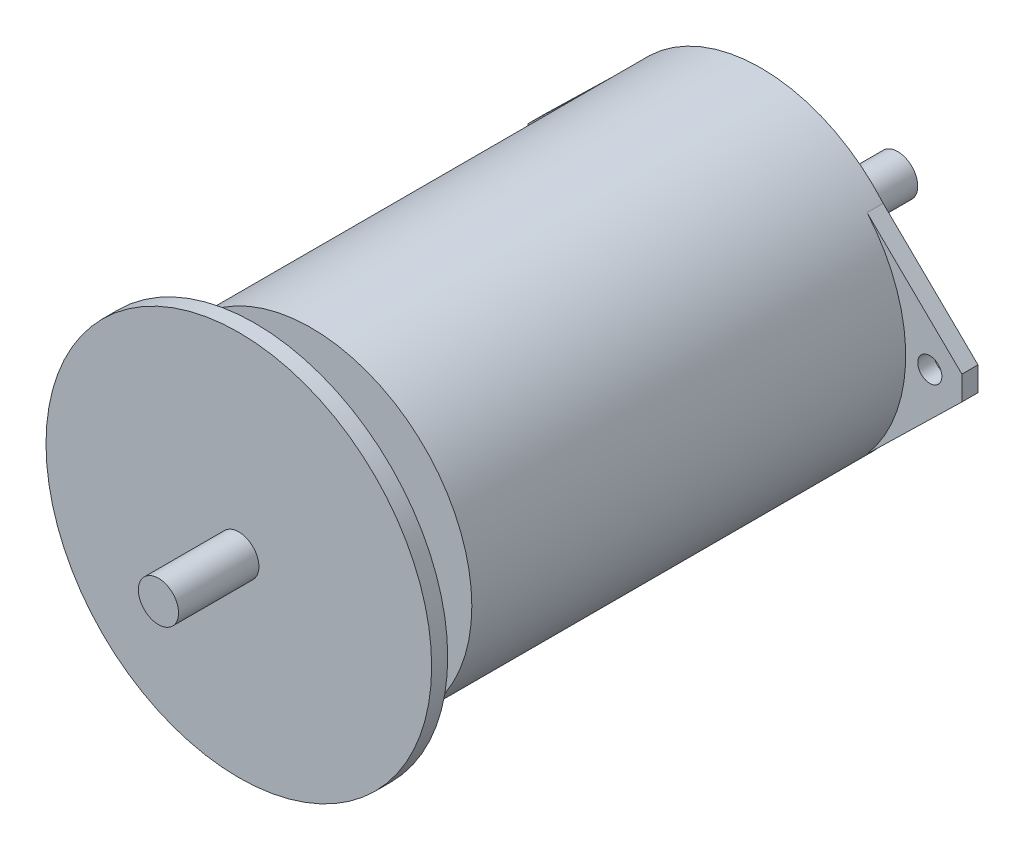
ISO-10303-21;
HEADER;
FILE_DESCRIPTION(('STEP AP214'),'2;1');
FILE_NAME('part.step','',(''),(''),'','','');
FILE_SCHEMA(('AUTOMOTIVE_DESIGN { 1 0 10303 214 1 1 1 1 }'));
ENDSEC;
DATA;
#1=APPLICATION_CONTEXT('core data for automotive mechanical design processes');
#2=APPLICATION_PROTOCOL_DEFINITION('international standard','automotive_design',2000,#1);
#3=PRODUCT_CONTEXT('',#1,'mechanical');
#4=PRODUCT('Part','Part','',(#3));
#5=PRODUCT_RELATED_PRODUCT_CATEGORY('part','',(#4));
#6=PRODUCT_DEFINITION_FORMATION('','',#4);
#7=PRODUCT_DEFINITION_CONTEXT('part definition',#1,'design');
#8=PRODUCT_DEFINITION('design','',#6,#7);
#9=PRODUCT_DEFINITION_SHAPE('','',#8);
#10=(LENGTH_UNIT() NAMED_UNIT(*) SI_UNIT(.MILLI.,.METRE.));
#11=(NAMED_UNIT(*) PLANE_ANGLE_UNIT() SI_UNIT($,.RADIAN.));
#12=(NAMED_UNIT(*) SI_UNIT($,.STERADIAN.) SOLID_ANGLE_UNIT());
#13=UNCERTAINTY_MEASURE_WITH_UNIT(LENGTH_MEASURE(1.E-05),#10,'distance_accuracy_value','');
#14=(GEOMETRIC_REPRESENTATION_CONTEXT(3) GLOBAL_UNCERTAINTY_ASSIGNED_CONTEXT((#13)) GLOBAL_UNIT_ASSIGNED_CONTEXT((#10,
#11,#12)) REPRESENTATION_CONTEXT('',''));
#15=CARTESIAN_POINT('',(0.,0.,0.));
#16=DIRECTION('',(0.,0.,1.));
#17=DIRECTION('',(1.,0.,0.));
#18=AXIS2_PLACEMENT_3D('',#15,#16,#17);
#19=CARTESIAN_POINT('',(-44.2121087681845,22.8987714087123,-17.));
#20=DIRECTION('',(0.,0.,1.));
#21=DIRECTION('',(1.,0.,0.));
#22=AXIS2_PLACEMENT_3D('',#19,#20,#21);
#23=CYLINDRICAL_SURFACE('',#22,2.49999999999999);
#24=CARTESIAN_POINT('',(-44.2121087681845,22.8987714087123,56.));
#25=DIRECTION('',(0.,0.,1.));
#26=DIRECTION('',(1.,0.,0.));
#27=AXIS2_PLACEMENT_3D('',#24,#25,#26);
#28=CIRCLE('',#27,2.49999999999999);
#29=CARTESIAN_POINT('',(-41.7121087681845,22.8987714087123,56.));
#30=VERTEX_POINT('',#29);
#31=EDGE_CURVE('E11',#30,#30,#28,.T.);
#32=ORIENTED_EDGE('',*,*,#31,.T.);
#33=EDGE_LOOP('',(#32));
#34=FACE_BOUND('',#33,.T.);
#35=CARTESIAN_POINT('',(-44.2121087681845,22.8987714087123,63.));
#36=DIRECTION('',(0.,0.,1.));
#37=DIRECTION('',(1.,0.,0.));
#38=AXIS2_PLACEMENT_3D('',#35,#36,#37);
#39=CIRCLE('',#38,2.49999999999999);
#40=CARTESIAN_POINT('',(-41.7121087681845,22.8987714087123,63.));
#41=VERTEX_POINT('',#40);
#42=EDGE_CURVE('E392',#41,#41,#39,.T.);
#43=ORIENTED_EDGE('',*,*,#42,.F.);
#44=EDGE_LOOP('',(#43));
#45=FACE_BOUND('',#44,.T.);
#46=ADVANCED_FACE('F34',(#34,#45),#23,.T.);
#47=CARTESIAN_POINT('',(-44.2121087681849,22.898771408712,56.));
#48=DIRECTION('',(0.,0.,-1.));
#49=DIRECTION('',(-1.,0.,0.));
#50=AXIS2_PLACEMENT_3D('',#47,#48,#49);
#51=CYLINDRICAL_SURFACE('',#50,20.);
#52=CARTESIAN_POINT('',(-44.2121087681849,22.898771408712,56.));
#53=DIRECTION('',(0.,0.,1.));
#54=DIRECTION('',(1.,0.,0.));
#55=AXIS2_PLACEMENT_3D('',#52,#53,#54);
#56=CIRCLE('',#55,20.);
#57=CARTESIAN_POINT('',(-24.2121087681849,22.898771408712,56.));
#58=VERTEX_POINT('',#57);
#59=EDGE_CURVE('E43',#58,#58,#56,.T.);
#60=ORIENTED_EDGE('',*,*,#59,.F.);
#61=EDGE_LOOP('',(#60));
#62=FACE_BOUND('',#61,.T.);
#63=CARTESIAN_POINT('',(-44.2121087681849,22.898771408712,0.));
#64=DIRECTION('',(0.,0.,1.));
#65=DIRECTION('',(1.,0.,0.));
#66=AXIS2_PLACEMENT_3D('',#63,#64,#65);
#67=CIRCLE('',#66,20.);
#68=CARTESIAN_POINT('',(-29.0183486906998,35.9045260853088,0.));
#69=VERTEX_POINT('',#68);
#70=CARTESIAN_POINT('',(-59.4058688456781,35.9045260852993,0.));
#71=VERTEX_POINT('',#70);
#72=EDGE_CURVE('E38',#69,#71,#67,.T.);
#73=ORIENTED_EDGE('',*,*,#72,.T.);
#74=DIRECTION('',(0.,0.,-1.));
#75=VECTOR('',#74,1.);
#76=CARTESIAN_POINT('',(-59.4058688456781,35.9045260852993,2.));
#77=LINE('',#76,#75);
#78=CARTESIAN_POINT('',(-59.4058688456781,35.9045260852993,2.));
#79=VERTEX_POINT('',#78);
#80=EDGE_CURVE('E56',#79,#71,#77,.T.);
#81=ORIENTED_EDGE('',*,*,#80,.F.);
#82=CARTESIAN_POINT('',(-44.2121087681849,22.898771408712,2.));
#83=DIRECTION('',(0.,0.,1.));
#84=DIRECTION('',(1.,0.,0.));
#85=AXIS2_PLACEMENT_3D('',#82,#83,#84);
#86=CIRCLE('',#85,20.);
#87=CARTESIAN_POINT('',(-59.4058688456781,9.89301673212458,2.));
#88=VERTEX_POINT('',#87);
#89=EDGE_CURVE('E51',#79,#88,#86,.T.);
#90=ORIENTED_EDGE('',*,*,#89,.T.);
#91=DIRECTION('',(0.,0.,-1.));
#92=VECTOR('',#91,1.);
#93=CARTESIAN_POINT('',(-59.4058688456781,9.89301673212458,2.));
#94=LINE('',#93,#92);
#95=CARTESIAN_POINT('',(-59.4058688456781,9.89301673212458,0.));
#96=VERTEX_POINT('',#95);
#97=EDGE_CURVE('E121',#88,#96,#94,.T.);
#98=ORIENTED_EDGE('',*,*,#97,.T.);
#99=CARTESIAN_POINT('',(-29.0183486906925,9.89301673212366,0.));
#100=VERTEX_POINT('',#99);
#101=EDGE_CURVE('E174',#96,#100,#67,.T.);
#102=ORIENTED_EDGE('',*,*,#101,.T.);
#103=DIRECTION('',(0.,0.,-1.));
#104=VECTOR('',#103,1.);
#105=CARTESIAN_POINT('',(-29.0183486906925,9.89301673212368,2.));
#106=LINE('',#105,#104);
#107=CARTESIAN_POINT('',(-29.0183486906925,9.89301673212368,2.));
#108=VERTEX_POINT('',#107);
#109=EDGE_CURVE('E172',#108,#100,#106,.T.);
#110=ORIENTED_EDGE('',*,*,#109,.F.);
#111=CARTESIAN_POINT('',(-44.2121087681849,22.898771408712,2.));
#112=DIRECTION('',(0.,0.,1.));
#113=DIRECTION('',(1.,0.,0.));
#114=AXIS2_PLACEMENT_3D('',#111,#112,#113);
#115=CIRCLE('',#114,20.);
#116=CARTESIAN_POINT('',(-29.0183486906998,35.9045260853088,2.));
#117=VERTEX_POINT('',#116);
#118=EDGE_CURVE('E143',#108,#117,#115,.T.);
#119=ORIENTED_EDGE('',*,*,#118,.T.);
#120=DIRECTION('',(0.,0.,-1.));
#121=VECTOR('',#120,1.);
#122=CARTESIAN_POINT('',(-29.0183486906998,35.9045260853088,2.));
#123=LINE('',#122,#121);
#124=EDGE_CURVE('E155',#117,#69,#123,.T.);
#125=ORIENTED_EDGE('',*,*,#124,.T.);
#126=EDGE_LOOP('',(#73,#81,#90,#98,#102,#110,#119,#125));
#127=FACE_BOUND('',#126,.T.);
#128=ADVANCED_FACE('F36',(#62,#127),#51,.T.);
#129=CARTESIAN_POINT('',(-44.2121087681849,22.898771408712,56.));
#130=DIRECTION('',(0.,0.,1.));
#131=DIRECTION('',(1.,0.,0.));
#132=AXIS2_PLACEMENT_3D('',#129,#130,#131);
#133=PLANE('',#132);
#134=ORIENTED_EDGE('',*,*,#31,.F.);
#135=EDGE_LOOP('',(#134));
#136=FACE_BOUND('',#135,.T.);
#137=ORIENTED_EDGE('',*,*,#59,.T.);
#138=EDGE_LOOP('',(#137));
#139=FACE_BOUND('',#138,.T.);
#140=ADVANCED_FACE('F218',(#136,#139),#133,.T.);
#141=CARTESIAN_POINT('',(-44.2121087681849,22.898771408712,0.));
#142=DIRECTION('',(0.,0.,1.));
#143=DIRECTION('',(1.,0.,0.));
#144=AXIS2_PLACEMENT_3D('',#141,#142,#143);
#145=PLANE('',#144);
#146=CARTESIAN_POINT('',(-44.2121087681849,22.898771408712,0.));
#147=DIRECTION('',(0.,0.,1.));
#148=DIRECTION('',(1.,0.,0.));
#149=AXIS2_PLACEMENT_3D('',#146,#147,#148);
#150=CIRCLE('',#149,9.);
#151=CARTESIAN_POINT('',(-35.2121087681849,22.898771408712,0.));
#152=VERTEX_POINT('',#151);
#153=EDGE_CURVE('E244',#152,#152,#150,.T.);
#154=ORIENTED_EDGE('',*,*,#153,.T.);
#155=EDGE_LOOP('',(#154));
#156=FACE_BOUND('',#155,.T.);
#157=ORIENTED_EDGE('',*,*,#72,.F.);
#158=DIRECTION('',(-0.716144688760475,0.697951849886626,0.));
#159=VECTOR('',#158,1.);
#160=CARTESIAN_POINT('',(3.81041613341323,3.90973858204455,0.));
#161=LINE('',#160,#159);
#162=CARTESIAN_POINT('',(-17.2123905551227,24.3984848484854,0.));
#163=VERTEX_POINT('',#162);
#164=EDGE_CURVE('E144',#163,#69,#161,.T.);
#165=ORIENTED_EDGE('',*,*,#164,.F.);
#166=DIRECTION('',(0.,-1.,0.));
#167=VECTOR('',#166,1.);
#168=CARTESIAN_POINT('',(-17.2123905551229,0.,0.));
#169=LINE('',#168,#167);
#170=CARTESIAN_POINT('',(-17.2123905551228,21.3990579689396,0.));
#171=VERTEX_POINT('',#170);
#172=EDGE_CURVE('E161',#163,#171,#169,.T.);
#173=ORIENTED_EDGE('',*,*,#172,.T.);
#174=DIRECTION('',(-0.716144688760485,-0.697951849886615,0.));
#175=VECTOR('',#174,1.);
#176=CARTESIAN_POINT('',(-19.0807762539914,19.5781364773845,0.));
#177=LINE('',#176,#175);
#178=EDGE_CURVE('E158',#171,#100,#177,.T.);
#179=ORIENTED_EDGE('',*,*,#178,.T.);
#180=ORIENTED_EDGE('',*,*,#101,.F.);
#181=DIRECTION('',(0.71614468876048,-0.69795184988662,0.));
#182=VECTOR('',#181,1.);
#183=CARTESIAN_POINT('',(-23.9939127716081,-24.6193389941738,0.));
#184=LINE('',#183,#182);
#185=CARTESIAN_POINT('',(-71.2118269812462,21.3990579689391,0.));
#186=VERTEX_POINT('',#185);
#187=EDGE_CURVE('E132',#186,#96,#184,.T.);
#188=ORIENTED_EDGE('',*,*,#187,.F.);
#189=DIRECTION('',(0.,1.,0.));
#190=VECTOR('',#189,1.);
#191=CARTESIAN_POINT('',(-71.2118269812462,0.,0.));
#192=LINE('',#191,#190);
#193=CARTESIAN_POINT('',(-71.2118269812462,24.3984848484849,0.));
#194=VERTEX_POINT('',#193);
#195=EDGE_CURVE('E130',#186,#194,#192,.T.);
#196=ORIENTED_EDGE('',*,*,#195,.T.);
#197=DIRECTION('',(0.71614468876048,0.69795184988662,0.));
#198=VECTOR('',#197,1.);
#199=CARTESIAN_POINT('',(-46.8851051590124,48.1072140536023,0.));
#200=LINE('',#199,#198);
#201=EDGE_CURVE('E105',#194,#71,#200,.T.);
#202=ORIENTED_EDGE('',*,*,#201,.T.);
#203=EDGE_LOOP('',(#157,#165,#173,#179,#180,#188,#196,#202));
#204=FACE_BOUND('',#203,.T.);
#205=CARTESIAN_POINT('',(-21.2121087681849,22.898771408712,0.));
#206=DIRECTION('',(0.,0.,1.));
#207=DIRECTION('',(1.,0.,0.));
#208=AXIS2_PLACEMENT_3D('',#205,#206,#207);
#209=CIRCLE('',#208,1.5);
#210=CARTESIAN_POINT('',(-19.7121087681849,22.898771408712,0.));
#211=VERTEX_POINT('',#210);
#212=EDGE_CURVE('E139',#211,#211,#209,.T.);
#213=ORIENTED_EDGE('',*,*,#212,.T.);
#214=EDGE_LOOP('',(#213));
#215=FACE_BOUND('',#214,.T.);
#216=CARTESIAN_POINT('',(-67.2121087681849,22.8987714087121,0.));
#217=DIRECTION('',(0.,0.,1.));
#218=DIRECTION('',(1.,0.,0.));
#219=AXIS2_PLACEMENT_3D('',#216,#217,#218);
#220=CIRCLE('',#219,1.50000000000001);
#221=CARTESIAN_POINT('',(-65.7121087681849,22.8987714087121,0.));
#222=VERTEX_POINT('',#221);
#223=EDGE_CURVE('E125',#222,#222,#220,.T.);
#224=ORIENTED_EDGE('',*,*,#223,.T.);
#225=EDGE_LOOP('',(#224));
#226=FACE_BOUND('',#225,.T.);
#227=ADVANCED_FACE('F186',(#156,#204,#215,#226),#145,.F.);
#228=CARTESIAN_POINT('',(-19.0807762539914,19.5781364773845,2.));
#229=DIRECTION('',(0.697951849886615,-0.716144688760485,0.));
#230=DIRECTION('',(0.716144688760485,0.697951849886615,0.));
#231=AXIS2_PLACEMENT_3D('',#228,#229,#230);
#232=PLANE('',#231);
#233=ORIENTED_EDGE('',*,*,#178,.F.);
#234=DIRECTION('',(0.,0.,-1.));
#235=VECTOR('',#234,1.);
#236=CARTESIAN_POINT('',(-17.2123905551228,21.3990579689396,2.));
#237=LINE('',#236,#235);
#238=CARTESIAN_POINT('',(-17.2123905551228,21.3990579689396,2.));
#239=VERTEX_POINT('',#238);
#240=EDGE_CURVE('E170',#239,#171,#237,.T.);
#241=ORIENTED_EDGE('',*,*,#240,.F.);
#242=DIRECTION('',(-0.716144688760485,-0.697951849886615,0.));
#243=VECTOR('',#242,1.);
#244=CARTESIAN_POINT('',(-19.0807762539914,19.5781364773845,2.));
#245=LINE('',#244,#243);
#246=EDGE_CURVE('E146',#239,#108,#245,.T.);
#247=ORIENTED_EDGE('',*,*,#246,.T.);
#248=ORIENTED_EDGE('',*,*,#109,.T.);
#249=EDGE_LOOP('',(#233,#241,#247,#248));
#250=FACE_BOUND('',#249,.T.);
#251=ADVANCED_FACE('F184',(#250),#232,.T.);
#252=CARTESIAN_POINT('',(-17.2123905551229,0.,2.));
#253=DIRECTION('',(1.,0.,0.));
#254=DIRECTION('',(0.,1.,0.));
#255=AXIS2_PLACEMENT_3D('',#252,#253,#254);
#256=PLANE('',#255);
#257=ORIENTED_EDGE('',*,*,#172,.F.);
#258=DIRECTION('',(0.,0.,-1.));
#259=VECTOR('',#258,1.);
#260=CARTESIAN_POINT('',(-17.2123905551227,24.3984848484854,2.));
#261=LINE('',#260,#259);
#262=CARTESIAN_POINT('',(-17.2123905551227,24.3984848484854,2.));
#263=VERTEX_POINT('',#262);
#264=EDGE_CURVE('E168',#263,#163,#261,.T.);
#265=ORIENTED_EDGE('',*,*,#264,.F.);
#266=DIRECTION('',(0.,-1.,0.));
#267=VECTOR('',#266,1.);
#268=CARTESIAN_POINT('',(-17.2123905551229,0.,2.));
#269=LINE('',#268,#267);
#270=EDGE_CURVE('E149',#263,#239,#269,.T.);
#271=ORIENTED_EDGE('',*,*,#270,.T.);
#272=ORIENTED_EDGE('',*,*,#240,.T.);
#273=EDGE_LOOP('',(#257,#265,#271,#272));
#274=FACE_BOUND('',#273,.T.);
#275=ADVANCED_FACE('F191',(#274),#256,.T.);
#276=CARTESIAN_POINT('',(-21.2121087681849,22.898771408712,2.));
#277=DIRECTION('',(0.,0.,-1.));
#278=DIRECTION('',(-1.,0.,0.));
#279=AXIS2_PLACEMENT_3D('',#276,#277,#278);
#280=CYLINDRICAL_SURFACE('',#279,1.5);
#281=CARTESIAN_POINT('',(-21.2121087681849,22.898771408712,2.));
#282=DIRECTION('',(0.,0.,1.));
#283=DIRECTION('',(1.,0.,0.));
#284=AXIS2_PLACEMENT_3D('',#281,#282,#283);
#285=CIRCLE('',#284,1.5);
#286=CARTESIAN_POINT('',(-19.7121087681849,22.898771408712,2.));
#287=VERTEX_POINT('',#286);
#288=EDGE_CURVE('E140',#287,#287,#285,.T.);
#289=ORIENTED_EDGE('',*,*,#288,.T.);
#290=EDGE_LOOP('',(#289));
#291=FACE_BOUND('',#290,.T.);
#292=ORIENTED_EDGE('',*,*,#212,.F.);
#293=EDGE_LOOP('',(#292));
#294=FACE_BOUND('',#293,.T.);
#295=ADVANCED_FACE('F200',(#291,#294),#280,.F.);
#296=CARTESIAN_POINT('',(3.81041613341323,3.90973858204455,2.));
#297=DIRECTION('',(-0.697951849886626,-0.716144688760475,0.));
#298=DIRECTION('',(0.716144688760475,-0.697951849886626,0.));
#299=AXIS2_PLACEMENT_3D('',#296,#297,#298);
#300=PLANE('',#299);
#301=ORIENTED_EDGE('',*,*,#164,.T.);
#302=ORIENTED_EDGE('',*,*,#124,.F.);
#303=DIRECTION('',(-0.716144688760475,0.697951849886626,0.));
#304=VECTOR('',#303,1.);
#305=CARTESIAN_POINT('',(3.81041613341323,3.90973858204455,2.));
#306=LINE('',#305,#304);
#307=EDGE_CURVE('E152',#263,#117,#306,.T.);
#308=ORIENTED_EDGE('',*,*,#307,.F.);
#309=ORIENTED_EDGE('',*,*,#264,.T.);
#310=EDGE_LOOP('',(#301,#302,#308,#309));
#311=FACE_BOUND('',#310,.T.);
#312=ADVANCED_FACE('F198',(#311),#300,.F.);
#313=CARTESIAN_POINT('',(0.,0.,2.));
#314=DIRECTION('',(0.,0.,1.));
#315=DIRECTION('',(1.,0.,0.));
#316=AXIS2_PLACEMENT_3D('',#313,#314,#315);
#317=PLANE('',#316);
#318=ORIENTED_EDGE('',*,*,#288,.F.);
#319=EDGE_LOOP('',(#318));
#320=FACE_BOUND('',#319,.T.);
#321=ORIENTED_EDGE('',*,*,#118,.F.);
#322=ORIENTED_EDGE('',*,*,#246,.F.);
#323=ORIENTED_EDGE('',*,*,#270,.F.);
#324=ORIENTED_EDGE('',*,*,#307,.T.);
#325=EDGE_LOOP('',(#321,#322,#323,#324));
#326=FACE_BOUND('',#325,.T.);
#327=ADVANCED_FACE('F195',(#320,#326),#317,.T.);
#328=CARTESIAN_POINT('',(-46.8851051590124,48.1072140536023,2.));
#329=DIRECTION('',(-0.69795184988662,0.71614468876048,0.));
#330=DIRECTION('',(-0.71614468876048,-0.69795184988662,0.));
#331=AXIS2_PLACEMENT_3D('',#328,#329,#330);
#332=PLANE('',#331);
#333=ORIENTED_EDGE('',*,*,#201,.F.);
#334=DIRECTION('',(0.,0.,-1.));
#335=VECTOR('',#334,1.);
#336=CARTESIAN_POINT('',(-71.2118269812462,24.3984848484849,2.));
#337=LINE('',#336,#335);
#338=CARTESIAN_POINT('',(-71.2118269812462,24.3984848484849,2.));
#339=VERTEX_POINT('',#338);
#340=EDGE_CURVE('E100',#339,#194,#337,.T.);
#341=ORIENTED_EDGE('',*,*,#340,.F.);
#342=DIRECTION('',(0.71614468876048,0.69795184988662,0.));
#343=VECTOR('',#342,1.);
#344=CARTESIAN_POINT('',(-46.8851051590124,48.1072140536023,2.));
#345=LINE('',#344,#343);
#346=EDGE_CURVE('E103',#339,#79,#345,.T.);
#347=ORIENTED_EDGE('',*,*,#346,.T.);
#348=ORIENTED_EDGE('',*,*,#80,.T.);
#349=EDGE_LOOP('',(#333,#341,#347,#348));
#350=FACE_BOUND('',#349,.T.);
#351=ADVANCED_FACE('F102',(#350),#332,.T.);
#352=CARTESIAN_POINT('',(-71.2118269812462,0.,2.));
#353=DIRECTION('',(-1.,0.,0.));
#354=DIRECTION('',(0.,0.,1.));
#355=AXIS2_PLACEMENT_3D('',#352,#353,#354);
#356=PLANE('',#355);
#357=ORIENTED_EDGE('',*,*,#195,.F.);
#358=DIRECTION('',(0.,0.,-1.));
#359=VECTOR('',#358,1.);
#360=CARTESIAN_POINT('',(-71.2118269812462,21.3990579689391,2.));
#361=LINE('',#360,#359);
#362=CARTESIAN_POINT('',(-71.2118269812462,21.3990579689391,2.));
#363=VERTEX_POINT('',#362);
#364=EDGE_CURVE('E110',#363,#186,#361,.T.);
#365=ORIENTED_EDGE('',*,*,#364,.F.);
#366=DIRECTION('',(0.,1.,0.));
#367=VECTOR('',#366,1.);
#368=CARTESIAN_POINT('',(-71.2118269812462,0.,2.));
#369=LINE('',#368,#367);
#370=EDGE_CURVE('E115',#363,#339,#369,.T.);
#371=ORIENTED_EDGE('',*,*,#370,.T.);
#372=ORIENTED_EDGE('',*,*,#340,.T.);
#373=EDGE_LOOP('',(#357,#365,#371,#372));
#374=FACE_BOUND('',#373,.T.);
#375=ADVANCED_FACE('F117',(#374),#356,.T.);
#376=CARTESIAN_POINT('',(-67.2121087681849,22.8987714087121,2.));
#377=DIRECTION('',(0.,0.,-1.));
#378=DIRECTION('',(-1.,0.,0.));
#379=AXIS2_PLACEMENT_3D('',#376,#377,#378);
#380=CYLINDRICAL_SURFACE('',#379,1.50000000000001);
#381=CARTESIAN_POINT('',(-67.2121087681849,22.8987714087121,2.));
#382=DIRECTION('',(0.,0.,1.));
#383=DIRECTION('',(1.,0.,0.));
#384=AXIS2_PLACEMENT_3D('',#381,#382,#383);
#385=CIRCLE('',#384,1.50000000000001);
#386=CARTESIAN_POINT('',(-65.7121087681849,22.8987714087121,2.));
#387=VERTEX_POINT('',#386);
#388=EDGE_CURVE('E135',#387,#387,#385,.T.);
#389=ORIENTED_EDGE('',*,*,#388,.T.);
#390=EDGE_LOOP('',(#389));
#391=FACE_BOUND('',#390,.T.);
#392=ORIENTED_EDGE('',*,*,#223,.F.);
#393=EDGE_LOOP('',(#392));
#394=FACE_BOUND('',#393,.T.);
#395=ADVANCED_FACE('F257',(#391,#394),#380,.F.);
#396=CARTESIAN_POINT('',(-23.9939127716081,-24.6193389941738,2.));
#397=DIRECTION('',(0.69795184988662,0.71614468876048,0.));
#398=DIRECTION('',(-0.71614468876048,0.69795184988662,0.));
#399=AXIS2_PLACEMENT_3D('',#396,#397,#398);
#400=PLANE('',#399);
#401=ORIENTED_EDGE('',*,*,#187,.T.);
#402=ORIENTED_EDGE('',*,*,#97,.F.);
#403=DIRECTION('',(0.71614468876048,-0.69795184988662,0.));
#404=VECTOR('',#403,1.);
#405=CARTESIAN_POINT('',(-23.9939127716081,-24.6193389941738,2.));
#406=LINE('',#405,#404);
#407=EDGE_CURVE('E119',#363,#88,#406,.T.);
#408=ORIENTED_EDGE('',*,*,#407,.F.);
#409=ORIENTED_EDGE('',*,*,#364,.T.);
#410=EDGE_LOOP('',(#401,#402,#408,#409));
#411=FACE_BOUND('',#410,.T.);
#412=ADVANCED_FACE('F262',(#411),#400,.F.);
#413=CARTESIAN_POINT('',(0.,0.,2.));
#414=DIRECTION('',(0.,0.,1.));
#415=DIRECTION('',(1.,0.,0.));
#416=AXIS2_PLACEMENT_3D('',#413,#414,#415);
#417=PLANE('',#416);
#418=ORIENTED_EDGE('',*,*,#388,.F.);
#419=EDGE_LOOP('',(#418));
#420=FACE_BOUND('',#419,.T.);
#421=ORIENTED_EDGE('',*,*,#89,.F.);
#422=ORIENTED_EDGE('',*,*,#346,.F.);
#423=ORIENTED_EDGE('',*,*,#370,.F.);
#424=ORIENTED_EDGE('',*,*,#407,.T.);
#425=EDGE_LOOP('',(#421,#422,#423,#424));
#426=FACE_BOUND('',#425,.T.);
#427=ADVANCED_FACE('F114',(#420,#426),#417,.T.);
#428=CARTESIAN_POINT('',(-44.2121087681849,22.898771408712,-4.));
#429=DIRECTION('',(0.,0.,1.));
#430=DIRECTION('',(1.,0.,0.));
#431=AXIS2_PLACEMENT_3D('',#428,#429,#430);
#432=CYLINDRICAL_SURFACE('',#431,9.);
#433=CARTESIAN_POINT('',(-44.2121087681849,22.898771408712,-4.));
#434=DIRECTION('',(0.,0.,1.));
#435=DIRECTION('',(1.,0.,0.));
#436=AXIS2_PLACEMENT_3D('',#433,#434,#435);
#437=CIRCLE('',#436,9.);
#438=CARTESIAN_POINT('',(-35.2121087681849,22.898771408712,-4.));
#439=VERTEX_POINT('',#438);
#440=EDGE_CURVE('E128',#439,#439,#437,.T.);
#441=ORIENTED_EDGE('',*,*,#440,.T.);
#442=EDGE_LOOP('',(#441));
#443=FACE_BOUND('',#442,.T.);
#444=ORIENTED_EDGE('',*,*,#153,.F.);
#445=EDGE_LOOP('',(#444));
#446=FACE_BOUND('',#445,.T.);
#447=ADVANCED_FACE('F261',(#443,#446),#432,.T.);
#448=CARTESIAN_POINT('',(0.,0.,-4.));
#449=DIRECTION('',(0.,0.,1.));
#450=DIRECTION('',(1.,0.,0.));
#451=AXIS2_PLACEMENT_3D('',#448,#449,#450);
#452=PLANE('',#451);
#453=CARTESIAN_POINT('',(-44.2121087681845,22.8987714087123,-4.));
#454=DIRECTION('',(0.,0.,1.));
#455=DIRECTION('',(1.,0.,0.));
#456=AXIS2_PLACEMENT_3D('',#453,#454,#455);
#457=CIRCLE('',#456,2.49999999999999);
#458=CARTESIAN_POINT('',(-41.7121087681845,22.8987714087123,-4.));
#459=VERTEX_POINT('',#458);
#460=EDGE_CURVE('E242',#459,#459,#457,.T.);
#461=ORIENTED_EDGE('',*,*,#460,.T.);
#462=EDGE_LOOP('',(#461));
#463=FACE_BOUND('',#462,.T.);
#464=ORIENTED_EDGE('',*,*,#440,.F.);
#465=EDGE_LOOP('',(#464));
#466=FACE_BOUND('',#465,.T.);
#467=ADVANCED_FACE('F234',(#463,#466),#452,.F.);
#468=CARTESIAN_POINT('',(0.,0.,-17.));
#469=DIRECTION('',(0.,0.,1.));
#470=DIRECTION('',(1.,0.,0.));
#471=AXIS2_PLACEMENT_3D('',#468,#469,#470);
#472=PLANE('',#471);
#473=CARTESIAN_POINT('',(-44.2121087681845,22.8987714087123,-17.));
#474=DIRECTION('',(0.,0.,1.));
#475=DIRECTION('',(1.,0.,0.));
#476=AXIS2_PLACEMENT_3D('',#473,#474,#475);
#477=CIRCLE('',#476,2.49999999999999);
#478=CARTESIAN_POINT('',(-41.7121087681845,22.8987714087123,-17.));
#479=VERTEX_POINT('',#478);
#480=EDGE_CURVE('E239',#479,#479,#477,.T.);
#481=ORIENTED_EDGE('',*,*,#480,.F.);
#482=EDGE_LOOP('',(#481));
#483=FACE_BOUND('',#482,.T.);
#484=ADVANCED_FACE('F225',(#483),#472,.F.);
#485=ORIENTED_EDGE('',*,*,#480,.T.);
#486=EDGE_LOOP('',(#485));
#487=FACE_BOUND('',#486,.T.);
#488=ORIENTED_EDGE('',*,*,#460,.F.);
#489=EDGE_LOOP('',(#488));
#490=FACE_BOUND('',#489,.T.);
#491=ADVANCED_FACE('F214',(#487,#490),#23,.T.);
#492=CARTESIAN_POINT('',(-44.2121087681845,22.8987714087123,63.));
#493=DIRECTION('',(0.,0.,1.));
#494=DIRECTION('',(1.,0.,0.));
#495=AXIS2_PLACEMENT_3D('',#492,#493,#494);
#496=CYLINDRICAL_SURFACE('',#495,24.);
#497=CARTESIAN_POINT('',(-44.2121087681845,22.8987714087123,63.));
#498=DIRECTION('',(0.,0.,1.));
#499=DIRECTION('',(1.,0.,0.));
#500=AXIS2_PLACEMENT_3D('',#497,#498,#499);
#501=CIRCLE('',#500,24.);
#502=CARTESIAN_POINT('',(-20.2121087681845,22.8987714087123,63.));
#503=VERTEX_POINT('',#502);
#504=EDGE_CURVE('E248',#503,#503,#501,.T.);
#505=ORIENTED_EDGE('',*,*,#504,.T.);
#506=EDGE_LOOP('',(#505));
#507=FACE_BOUND('',#506,.T.);
#508=CARTESIAN_POINT('',(-44.2121087681845,22.8987714087123,65.));
#509=DIRECTION('',(0.,0.,1.));
#510=DIRECTION('',(1.,0.,0.));
#511=AXIS2_PLACEMENT_3D('',#508,#509,#510);
#512=CIRCLE('',#511,24.);
#513=CARTESIAN_POINT('',(-20.2121087681845,22.8987714087123,65.));
#514=VERTEX_POINT('',#513);
#515=EDGE_CURVE('E396',#514,#514,#512,.T.);
#516=ORIENTED_EDGE('',*,*,#515,.F.);
#517=EDGE_LOOP('',(#516));
#518=FACE_BOUND('',#517,.T.);
#519=ADVANCED_FACE('F224',(#507,#518),#496,.T.);
#520=CARTESIAN_POINT('',(-44.2121087681845,22.8987714087123,63.));
#521=DIRECTION('',(0.,0.,1.));
#522=DIRECTION('',(1.,0.,0.));
#523=AXIS2_PLACEMENT_3D('',#520,#521,#522);
#524=PLANE('',#523);
#525=ORIENTED_EDGE('',*,*,#42,.T.);
#526=EDGE_LOOP('',(#525));
#527=FACE_BOUND('',#526,.T.);
#528=ORIENTED_EDGE('',*,*,#504,.F.);
#529=EDGE_LOOP('',(#528));
#530=FACE_BOUND('',#529,.T.);
#531=ADVANCED_FACE('F231',(#527,#530),#524,.F.);
#532=CARTESIAN_POINT('',(0.,0.,65.));
#533=DIRECTION('',(0.,0.,1.));
#534=DIRECTION('',(1.,0.,0.));
#535=AXIS2_PLACEMENT_3D('',#532,#533,#534);
#536=PLANE('',#535);
#537=CARTESIAN_POINT('',(-44.2121087681845,22.8987714087123,65.));
#538=DIRECTION('',(0.,0.,1.));
#539=DIRECTION('',(1.,0.,0.));
#540=AXIS2_PLACEMENT_3D('',#537,#538,#539);
#541=CIRCLE('',#540,2.5);
#542=CARTESIAN_POINT('',(-41.7121087681845,22.8987714087123,65.));
#543=VERTEX_POINT('',#542);
#544=EDGE_CURVE('E393',#543,#543,#541,.T.);
#545=ORIENTED_EDGE('',*,*,#544,.F.);
#546=EDGE_LOOP('',(#545));
#547=FACE_BOUND('',#546,.T.);
#548=ORIENTED_EDGE('',*,*,#515,.T.);
#549=EDGE_LOOP('',(#548));
#550=FACE_BOUND('',#549,.T.);
#551=ADVANCED_FACE('F355',(#547,#550),#536,.T.);
#552=CARTESIAN_POINT('',(-44.2121087681845,22.8987714087123,75.));
#553=DIRECTION('',(0.,0.,-1.));
#554=DIRECTION('',(-1.,0.,0.));
#555=AXIS2_PLACEMENT_3D('',#552,#553,#554);
#556=CYLINDRICAL_SURFACE('',#555,2.5);
#557=CARTESIAN_POINT('',(-44.2121087681845,22.8987714087123,75.));
#558=DIRECTION('',(0.,0.,1.));
#559=DIRECTION('',(1.,0.,0.));
#560=AXIS2_PLACEMENT_3D('',#557,#558,#559);
#561=CIRCLE('',#560,2.5);
#562=CARTESIAN_POINT('',(-41.7121087681845,22.8987714087123,75.));
#563=VERTEX_POINT('',#562);
#564=EDGE_CURVE('E391',#563,#563,#561,.T.);
#565=ORIENTED_EDGE('',*,*,#564,.F.);
#566=EDGE_LOOP('',(#565));
#567=FACE_BOUND('',#566,.T.);
#568=ORIENTED_EDGE('',*,*,#544,.T.);
#569=EDGE_LOOP('',(#568));
#570=FACE_BOUND('',#569,.T.);
#571=ADVANCED_FACE('F365',(#567,#570),#556,.T.);
#572=CARTESIAN_POINT('',(-44.2121087681845,22.8987714087123,75.));
#573=DIRECTION('',(0.,0.,1.));
#574=DIRECTION('',(1.,0.,0.));
#575=AXIS2_PLACEMENT_3D('',#572,#573,#574);
#576=PLANE('',#575);
#577=ORIENTED_EDGE('',*,*,#564,.T.);
#578=EDGE_LOOP('',(#577));
#579=FACE_BOUND('',#578,.T.);
#580=ADVANCED_FACE('F375',(#579),#576,.T.);
#581=CLOSED_SHELL('',(#46,#128,#140,#227,#251,#275,#295,#312,#327,#351,#375,#395,#412,#427,#447,
#467,#484,#491,#519,#531,#551,#571,#580));
#582=MANIFOLD_SOLID_BREP('B2',#581);
#583=ADVANCED_BREP_SHAPE_REPRESENTATION('',(#18,#582),#14);
#584=SHAPE_DEFINITION_REPRESENTATION(#9,#583);
ENDSEC;
END-ISO-10303-21;
